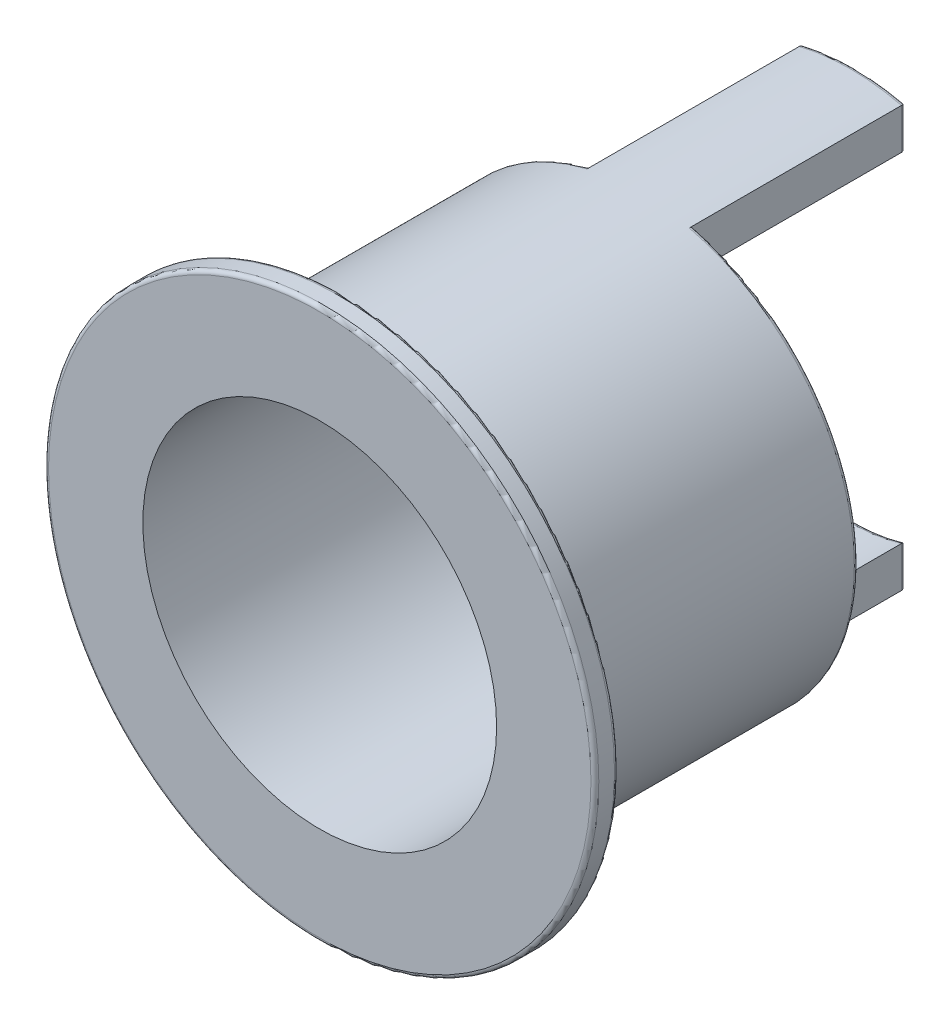
ISO-10303-21;
HEADER;
FILE_DESCRIPTION(('STEP AP214'),'2;1');
FILE_NAME('part.step','',(''),(''),'','','');
FILE_SCHEMA(('AUTOMOTIVE_DESIGN { 1 0 10303 214 1 1 1 1 }'));
ENDSEC;
DATA;
#1=APPLICATION_CONTEXT('core data for automotive mechanical design processes');
#2=APPLICATION_PROTOCOL_DEFINITION('international standard','automotive_design',2000,#1);
#3=PRODUCT_CONTEXT('',#1,'mechanical');
#4=PRODUCT('Part','Part','',(#3));
#5=PRODUCT_RELATED_PRODUCT_CATEGORY('part','',(#4));
#6=PRODUCT_DEFINITION_FORMATION('','',#4);
#7=PRODUCT_DEFINITION_CONTEXT('part definition',#1,'design');
#8=PRODUCT_DEFINITION('design','',#6,#7);
#9=PRODUCT_DEFINITION_SHAPE('','',#8);
#10=(LENGTH_UNIT() NAMED_UNIT(*) SI_UNIT(.MILLI.,.METRE.));
#11=(NAMED_UNIT(*) PLANE_ANGLE_UNIT() SI_UNIT($,.RADIAN.));
#12=(NAMED_UNIT(*) SI_UNIT($,.STERADIAN.) SOLID_ANGLE_UNIT());
#13=UNCERTAINTY_MEASURE_WITH_UNIT(LENGTH_MEASURE(1.E-05),#10,'distance_accuracy_value','');
#14=(GEOMETRIC_REPRESENTATION_CONTEXT(3) GLOBAL_UNCERTAINTY_ASSIGNED_CONTEXT((#13)) GLOBAL_UNIT_ASSIGNED_CONTEXT((#10,
#11,#12)) REPRESENTATION_CONTEXT('',''));
#15=CARTESIAN_POINT('',(0.,0.,0.));
#16=DIRECTION('',(0.,0.,1.));
#17=DIRECTION('',(1.,0.,0.));
#18=AXIS2_PLACEMENT_3D('',#15,#16,#17);
#19=CARTESIAN_POINT('',(0.,0.,0.3));
#20=DIRECTION('',(0.,0.,-1.));
#21=DIRECTION('',(-1.,0.,0.));
#22=AXIS2_PLACEMENT_3D('',#19,#20,#21);
#23=CYLINDRICAL_SURFACE('',#22,2.25);
#24=CARTESIAN_POINT('',(0.,0.,0.3));
#25=DIRECTION('',(0.,0.,1.));
#26=DIRECTION('',(1.,0.,0.));
#27=AXIS2_PLACEMENT_3D('',#24,#25,#26);
#28=CIRCLE('',#27,2.25);
#29=CARTESIAN_POINT('',(2.25,0.,0.3));
#30=VERTEX_POINT('',#29);
#31=EDGE_CURVE('E190',#30,#30,#28,.T.);
#32=ORIENTED_EDGE('',*,*,#31,.T.);
#33=EDGE_LOOP('',(#32));
#34=FACE_BOUND('',#33,.T.);
#35=DIRECTION('',(0.,0.,-1.));
#36=VECTOR('',#35,1.);
#37=CARTESIAN_POINT('',(0.65,-2.1540659228538,-3.8));
#38=LINE('',#37,#36);
#39=CARTESIAN_POINT('',(0.65,-2.1540659228538,-3.8));
#40=VERTEX_POINT('',#39);
#41=CARTESIAN_POINT('',(0.65,-2.1540659228538,-6.45));
#42=VERTEX_POINT('',#41);
#43=EDGE_CURVE('E183',#40,#42,#38,.T.);
#44=ORIENTED_EDGE('',*,*,#43,.T.);
#45=CARTESIAN_POINT('',(0.,0.,-6.45));
#46=DIRECTION('',(0.,0.,1.));
#47=DIRECTION('',(1.,0.,0.));
#48=AXIS2_PLACEMENT_3D('',#45,#46,#47);
#49=CIRCLE('',#48,2.25);
#50=CARTESIAN_POINT('',(-0.65,-2.1540659228538,-6.45));
#51=VERTEX_POINT('',#50);
#52=EDGE_CURVE('E230',#42,#51,#49,.F.);
#53=ORIENTED_EDGE('',*,*,#52,.T.);
#54=DIRECTION('',(0.,0.,-1.));
#55=VECTOR('',#54,1.);
#56=CARTESIAN_POINT('',(-0.65,-2.1540659228538,-3.8));
#57=LINE('',#56,#55);
#58=CARTESIAN_POINT('',(-0.65,-2.1540659228538,-3.8));
#59=VERTEX_POINT('',#58);
#60=EDGE_CURVE('E151',#59,#51,#57,.T.);
#61=ORIENTED_EDGE('',*,*,#60,.F.);
#62=CARTESIAN_POINT('',(0.,0.,-3.8));
#63=DIRECTION('',(0.,0.,-1.));
#64=DIRECTION('',(-1.,0.,0.));
#65=AXIS2_PLACEMENT_3D('',#62,#63,#64);
#66=CIRCLE('',#65,2.25);
#67=CARTESIAN_POINT('',(-0.65,2.1540659228538,-3.8));
#68=VERTEX_POINT('',#67);
#69=EDGE_CURVE('E158',#68,#59,#66,.F.);
#70=ORIENTED_EDGE('',*,*,#69,.F.);
#71=DIRECTION('',(0.,0.,-1.));
#72=VECTOR('',#71,1.);
#73=CARTESIAN_POINT('',(-0.65,2.1540659228538,-3.8));
#74=LINE('',#73,#72);
#75=CARTESIAN_POINT('',(-0.65,2.1540659228538,-6.45));
#76=VERTEX_POINT('',#75);
#77=EDGE_CURVE('E143',#68,#76,#74,.T.);
#78=ORIENTED_EDGE('',*,*,#77,.T.);
#79=CARTESIAN_POINT('',(0.,0.,-6.45));
#80=DIRECTION('',(0.,0.,1.));
#81=DIRECTION('',(1.,0.,0.));
#82=AXIS2_PLACEMENT_3D('',#79,#80,#81);
#83=CIRCLE('',#82,2.25);
#84=CARTESIAN_POINT('',(0.65,2.1540659228538,-6.45));
#85=VERTEX_POINT('',#84);
#86=EDGE_CURVE('E228',#76,#85,#83,.F.);
#87=ORIENTED_EDGE('',*,*,#86,.T.);
#88=DIRECTION('',(0.,0.,-1.));
#89=VECTOR('',#88,1.);
#90=CARTESIAN_POINT('',(0.65,2.1540659228538,-3.8));
#91=LINE('',#90,#89);
#92=CARTESIAN_POINT('',(0.65,2.1540659228538,-3.8));
#93=VERTEX_POINT('',#92);
#94=EDGE_CURVE('E180',#93,#85,#91,.T.);
#95=ORIENTED_EDGE('',*,*,#94,.F.);
#96=CARTESIAN_POINT('',(0.,0.,-3.8));
#97=DIRECTION('',(0.,0.,-1.));
#98=DIRECTION('',(-1.,0.,0.));
#99=AXIS2_PLACEMENT_3D('',#96,#97,#98);
#100=CIRCLE('',#99,2.25);
#101=EDGE_CURVE('E173',#40,#93,#100,.F.);
#102=ORIENTED_EDGE('',*,*,#101,.F.);
#103=EDGE_LOOP('',(#44,#53,#61,#70,#78,#87,#95,#102));
#104=FACE_BOUND('',#103,.T.);
#105=ADVANCED_FACE('F35',(#34,#104),#23,.F.);
#106=CARTESIAN_POINT('',(0.,0.,-6.5));
#107=DIRECTION('',(0.,0.,1.));
#108=DIRECTION('',(1.,0.,0.));
#109=AXIS2_PLACEMENT_3D('',#106,#107,#108);
#110=CYLINDRICAL_SURFACE('',#109,2.75);
#111=CARTESIAN_POINT('',(0.,0.,0.));
#112=DIRECTION('',(0.,0.,1.));
#113=DIRECTION('',(1.,0.,0.));
#114=AXIS2_PLACEMENT_3D('',#111,#112,#113);
#115=CIRCLE('',#114,2.75);
#116=CARTESIAN_POINT('',(2.75,0.,0.));
#117=VERTEX_POINT('',#116);
#118=EDGE_CURVE('E179',#117,#117,#115,.T.);
#119=ORIENTED_EDGE('',*,*,#118,.F.);
#120=EDGE_LOOP('',(#119));
#121=FACE_BOUND('',#120,.T.);
#122=DIRECTION('',(0.,0.,-1.));
#123=VECTOR('',#122,1.);
#124=CARTESIAN_POINT('',(-0.65,-2.67207784317748,-3.8));
#125=LINE('',#124,#123);
#126=CARTESIAN_POINT('',(-0.65,-2.67207784317748,-3.75));
#127=VERTEX_POINT('',#126);
#128=CARTESIAN_POINT('',(-0.65,-2.67207784317748,-6.45));
#129=VERTEX_POINT('',#128);
#130=EDGE_CURVE('E65',#127,#129,#125,.T.);
#131=ORIENTED_EDGE('',*,*,#130,.T.);
#132=CARTESIAN_POINT('',(0.,0.,-6.45));
#133=DIRECTION('',(0.,0.,1.));
#134=DIRECTION('',(1.,0.,0.));
#135=AXIS2_PLACEMENT_3D('',#132,#133,#134);
#136=CIRCLE('',#135,2.75);
#137=CARTESIAN_POINT('',(0.65,-2.67207784317748,-6.45));
#138=VERTEX_POINT('',#137);
#139=EDGE_CURVE('E226',#129,#138,#136,.T.);
#140=ORIENTED_EDGE('',*,*,#139,.T.);
#141=DIRECTION('',(0.,0.,-1.));
#142=VECTOR('',#141,1.);
#143=CARTESIAN_POINT('',(0.65,-2.67207784317748,-3.8));
#144=LINE('',#143,#142);
#145=CARTESIAN_POINT('',(0.65,-2.67207784317748,-3.75));
#146=VERTEX_POINT('',#145);
#147=EDGE_CURVE('E185',#146,#138,#144,.T.);
#148=ORIENTED_EDGE('',*,*,#147,.F.);
#149=CARTESIAN_POINT('',(0.,0.,-3.75));
#150=DIRECTION('',(0.,0.,-1.));
#151=DIRECTION('',(-1.,0.,0.));
#152=AXIS2_PLACEMENT_3D('',#149,#150,#151);
#153=CIRCLE('',#152,2.75);
#154=CARTESIAN_POINT('',(0.65,2.67207784317748,-3.75));
#155=VERTEX_POINT('',#154);
#156=EDGE_CURVE('E219',#146,#155,#153,.F.);
#157=ORIENTED_EDGE('',*,*,#156,.T.);
#158=DIRECTION('',(0.,0.,-1.));
#159=VECTOR('',#158,1.);
#160=CARTESIAN_POINT('',(0.65,2.67207784317748,-3.8));
#161=LINE('',#160,#159);
#162=CARTESIAN_POINT('',(0.65,2.67207784317748,-6.45));
#163=VERTEX_POINT('',#162);
#164=EDGE_CURVE('E176',#155,#163,#161,.T.);
#165=ORIENTED_EDGE('',*,*,#164,.T.);
#166=CARTESIAN_POINT('',(0.,0.,-6.45));
#167=DIRECTION('',(0.,0.,1.));
#168=DIRECTION('',(1.,0.,0.));
#169=AXIS2_PLACEMENT_3D('',#166,#167,#168);
#170=CIRCLE('',#169,2.75);
#171=CARTESIAN_POINT('',(-0.65,2.67207784317748,-6.45));
#172=VERTEX_POINT('',#171);
#173=EDGE_CURVE('E224',#163,#172,#170,.T.);
#174=ORIENTED_EDGE('',*,*,#173,.T.);
#175=DIRECTION('',(0.,0.,-1.));
#176=VECTOR('',#175,1.);
#177=CARTESIAN_POINT('',(-0.65,2.67207784317748,-3.8));
#178=LINE('',#177,#176);
#179=CARTESIAN_POINT('',(-0.65,2.67207784317748,-3.75));
#180=VERTEX_POINT('',#179);
#181=EDGE_CURVE('E57',#180,#172,#178,.T.);
#182=ORIENTED_EDGE('',*,*,#181,.F.);
#183=CARTESIAN_POINT('',(0.,0.,-3.75));
#184=DIRECTION('',(0.,0.,-1.));
#185=DIRECTION('',(-1.,0.,0.));
#186=AXIS2_PLACEMENT_3D('',#183,#184,#185);
#187=CIRCLE('',#186,2.75);
#188=EDGE_CURVE('E222',#180,#127,#187,.F.);
#189=ORIENTED_EDGE('',*,*,#188,.T.);
#190=EDGE_LOOP('',(#131,#140,#148,#157,#165,#174,#182,#189));
#191=FACE_BOUND('',#190,.T.);
#192=ADVANCED_FACE('F312',(#121,#191),#110,.T.);
#193=CARTESIAN_POINT('',(0.,0.,-6.5));
#194=DIRECTION('',(0.,0.,1.));
#195=DIRECTION('',(1.,0.,0.));
#196=AXIS2_PLACEMENT_3D('',#193,#194,#195);
#197=PLANE('',#196);
#198=DIRECTION('',(0.,1.,0.));
#199=VECTOR('',#198,1.);
#200=CARTESIAN_POINT('',(0.6,0.,-6.5));
#201=LINE('',#200,#199);
#202=CARTESIAN_POINT('',(0.6,-2.22036033111745,-6.5));
#203=VERTEX_POINT('',#202);
#204=CARTESIAN_POINT('',(0.6,-2.63248931621764,-6.5));
#205=VERTEX_POINT('',#204);
#206=EDGE_CURVE('E200',#203,#205,#201,.F.);
#207=ORIENTED_EDGE('',*,*,#206,.T.);
#208=CARTESIAN_POINT('',(0.,0.,-6.5));
#209=DIRECTION('',(0.,0.,1.));
#210=DIRECTION('',(1.,0.,0.));
#211=AXIS2_PLACEMENT_3D('',#208,#209,#210);
#212=CIRCLE('',#211,2.7);
#213=CARTESIAN_POINT('',(-0.6,-2.63248931621764,-6.5));
#214=VERTEX_POINT('',#213);
#215=EDGE_CURVE('E203',#205,#214,#212,.F.);
#216=ORIENTED_EDGE('',*,*,#215,.T.);
#217=DIRECTION('',(0.,1.,0.));
#218=VECTOR('',#217,1.);
#219=CARTESIAN_POINT('',(-0.6,-2.1540659228538,-6.5));
#220=LINE('',#219,#218);
#221=CARTESIAN_POINT('',(-0.6,-2.22036033111745,-6.5));
#222=VERTEX_POINT('',#221);
#223=EDGE_CURVE('E198',#214,#222,#220,.T.);
#224=ORIENTED_EDGE('',*,*,#223,.T.);
#225=CARTESIAN_POINT('',(0.,0.,-6.5));
#226=DIRECTION('',(0.,0.,1.));
#227=DIRECTION('',(1.,0.,0.));
#228=AXIS2_PLACEMENT_3D('',#225,#226,#227);
#229=CIRCLE('',#228,2.3);
#230=EDGE_CURVE('E196',#222,#203,#229,.T.);
#231=ORIENTED_EDGE('',*,*,#230,.T.);
#232=EDGE_LOOP('',(#207,#216,#224,#231));
#233=FACE_BOUND('',#232,.T.);
#234=ADVANCED_FACE('F280',(#233),#197,.F.);
#235=DIRECTION('',(0.,1.,0.));
#236=VECTOR('',#235,1.);
#237=CARTESIAN_POINT('',(0.6,0.,-6.5));
#238=LINE('',#237,#236);
#239=CARTESIAN_POINT('',(0.6,2.63248931621764,-6.5));
#240=VERTEX_POINT('',#239);
#241=CARTESIAN_POINT('',(0.6,2.22036033111745,-6.5));
#242=VERTEX_POINT('',#241);
#243=EDGE_CURVE('E209',#240,#242,#238,.F.);
#244=ORIENTED_EDGE('',*,*,#243,.T.);
#245=CARTESIAN_POINT('',(0.,0.,-6.5));
#246=DIRECTION('',(0.,0.,1.));
#247=DIRECTION('',(1.,0.,0.));
#248=AXIS2_PLACEMENT_3D('',#245,#246,#247);
#249=CIRCLE('',#248,2.3);
#250=CARTESIAN_POINT('',(-0.6,2.22036033111745,-6.5));
#251=VERTEX_POINT('',#250);
#252=EDGE_CURVE('E214',#242,#251,#249,.T.);
#253=ORIENTED_EDGE('',*,*,#252,.T.);
#254=DIRECTION('',(0.,1.,0.));
#255=VECTOR('',#254,1.);
#256=CARTESIAN_POINT('',(-0.6,2.67207784317748,-6.5));
#257=LINE('',#256,#255);
#258=CARTESIAN_POINT('',(-0.6,2.63248931621764,-6.5));
#259=VERTEX_POINT('',#258);
#260=EDGE_CURVE('E211',#251,#259,#257,.T.);
#261=ORIENTED_EDGE('',*,*,#260,.T.);
#262=CARTESIAN_POINT('',(0.,0.,-6.5));
#263=DIRECTION('',(0.,0.,1.));
#264=DIRECTION('',(1.,0.,0.));
#265=AXIS2_PLACEMENT_3D('',#262,#263,#264);
#266=CIRCLE('',#265,2.7);
#267=EDGE_CURVE('E207',#259,#240,#266,.F.);
#268=ORIENTED_EDGE('',*,*,#267,.T.);
#269=EDGE_LOOP('',(#244,#253,#261,#268));
#270=FACE_BOUND('',#269,.T.);
#271=ADVANCED_FACE('F325',(#270),#197,.F.);
#272=CARTESIAN_POINT('',(0.,0.,0.3));
#273=DIRECTION('',(0.,0.,-1.));
#274=DIRECTION('',(-1.,0.,0.));
#275=AXIS2_PLACEMENT_3D('',#272,#273,#274);
#276=CYLINDRICAL_SURFACE('',#275,3.5);
#277=CARTESIAN_POINT('',(0.,0.,0.05));
#278=DIRECTION('',(0.,0.,1.));
#279=DIRECTION('',(1.,0.,0.));
#280=AXIS2_PLACEMENT_3D('',#277,#278,#279);
#281=CIRCLE('',#280,3.5);
#282=CARTESIAN_POINT('',(3.5,0.,0.05));
#283=VERTEX_POINT('',#282);
#284=EDGE_CURVE('E239',#283,#283,#281,.T.);
#285=ORIENTED_EDGE('',*,*,#284,.T.);
#286=EDGE_LOOP('',(#285));
#287=FACE_BOUND('',#286,.T.);
#288=CARTESIAN_POINT('',(0.,0.,0.25));
#289=DIRECTION('',(0.,0.,1.));
#290=DIRECTION('',(1.,0.,0.));
#291=AXIS2_PLACEMENT_3D('',#288,#289,#290);
#292=CIRCLE('',#291,3.5);
#293=CARTESIAN_POINT('',(3.5,0.,0.25));
#294=VERTEX_POINT('',#293);
#295=EDGE_CURVE('E236',#294,#294,#292,.F.);
#296=ORIENTED_EDGE('',*,*,#295,.T.);
#297=EDGE_LOOP('',(#296));
#298=FACE_BOUND('',#297,.T.);
#299=ADVANCED_FACE('F322',(#287,#298),#276,.T.);
#300=CARTESIAN_POINT('',(0.,0.,0.3));
#301=DIRECTION('',(0.,0.,1.));
#302=DIRECTION('',(1.,0.,0.));
#303=AXIS2_PLACEMENT_3D('',#300,#301,#302);
#304=PLANE('',#303);
#305=CARTESIAN_POINT('',(0.,0.,0.3));
#306=DIRECTION('',(0.,0.,1.));
#307=DIRECTION('',(1.,0.,0.));
#308=AXIS2_PLACEMENT_3D('',#305,#306,#307);
#309=CIRCLE('',#308,3.45);
#310=CARTESIAN_POINT('',(3.45,0.,0.3));
#311=VERTEX_POINT('',#310);
#312=EDGE_CURVE('E245',#311,#311,#309,.T.);
#313=ORIENTED_EDGE('',*,*,#312,.T.);
#314=EDGE_LOOP('',(#313));
#315=FACE_BOUND('',#314,.T.);
#316=ORIENTED_EDGE('',*,*,#31,.F.);
#317=EDGE_LOOP('',(#316));
#318=FACE_BOUND('',#317,.T.);
#319=ADVANCED_FACE('F324',(#315,#318),#304,.T.);
#320=CARTESIAN_POINT('',(0.,0.,0.));
#321=DIRECTION('',(0.,0.,1.));
#322=DIRECTION('',(1.,0.,0.));
#323=AXIS2_PLACEMENT_3D('',#320,#321,#322);
#324=PLANE('',#323);
#325=CARTESIAN_POINT('',(0.,0.,0.));
#326=DIRECTION('',(0.,0.,1.));
#327=DIRECTION('',(1.,0.,0.));
#328=AXIS2_PLACEMENT_3D('',#325,#326,#327);
#329=CIRCLE('',#328,3.45);
#330=CARTESIAN_POINT('',(3.45,0.,0.));
#331=VERTEX_POINT('',#330);
#332=EDGE_CURVE('E242',#331,#331,#329,.F.);
#333=ORIENTED_EDGE('',*,*,#332,.T.);
#334=EDGE_LOOP('',(#333));
#335=FACE_BOUND('',#334,.T.);
#336=ORIENTED_EDGE('',*,*,#118,.T.);
#337=EDGE_LOOP('',(#336));
#338=FACE_BOUND('',#337,.T.);
#339=ADVANCED_FACE('F278',(#335,#338),#324,.F.);
#340=CARTESIAN_POINT('',(0.65,0.,-3.8));
#341=DIRECTION('',(-1.,0.,0.));
#342=DIRECTION('',(0.,0.,1.));
#343=AXIS2_PLACEMENT_3D('',#340,#341,#342);
#344=PLANE('',#343);
#345=ORIENTED_EDGE('',*,*,#94,.T.);
#346=DIRECTION('',(0.,1.,0.));
#347=VECTOR('',#346,1.);
#348=CARTESIAN_POINT('',(0.65,0.,-6.45));
#349=LINE('',#348,#347);
#350=EDGE_CURVE('E217',#85,#163,#349,.T.);
#351=ORIENTED_EDGE('',*,*,#350,.T.);
#352=ORIENTED_EDGE('',*,*,#164,.F.);
#353=CARTESIAN_POINT('',(0.65,2.67207784317748,-3.75));
#354=CARTESIAN_POINT('',(0.65,2.67208055437262,-3.75275502605494));
#355=CARTESIAN_POINT('',(0.65,2.67184367337058,-3.75550887652452));
#356=CARTESIAN_POINT('',(0.65,2.67091128787452,-3.76093353461634));
#357=CARTESIAN_POINT('',(0.65,2.67021650507589,-3.76360446600158));
#358=CARTESIAN_POINT('',(0.65,2.66838857025386,-3.76879227552283));
#359=CARTESIAN_POINT('',(0.65,2.66725532737399,-3.77130912160443));
#360=CARTESIAN_POINT('',(0.65,2.66458751791474,-3.77611996754771));
#361=CARTESIAN_POINT('',(0.65,2.66305293313147,-3.77841395729469));
#362=CARTESIAN_POINT('',(0.65,2.65960838468513,-3.78274563383212));
#363=CARTESIAN_POINT('',(0.65,2.65769411071335,-3.78477989003485));
#364=CARTESIAN_POINT('',(0.65,2.65355893043453,-3.78850866687454));
#365=CARTESIAN_POINT('',(0.65,2.65133795308354,-3.79020310857411));
#366=CARTESIAN_POINT('',(0.65,2.64658899650202,-3.79325265552838));
#367=CARTESIAN_POINT('',(0.65,2.64405434728814,-3.79459736339326));
#368=CARTESIAN_POINT('',(0.65,2.63879955290801,-3.79685443926644));
#369=CARTESIAN_POINT('',(0.65,2.63607943993308,-3.79776688208643));
#370=CARTESIAN_POINT('',(0.65,2.63122565780154,-3.79896721295384));
#371=CARTESIAN_POINT('',(0.65,2.62911590710765,-3.79935432499709));
#372=CARTESIAN_POINT('',(0.65,2.62486815133671,-3.79987072191155));
#373=CARTESIAN_POINT('',(0.65,2.62273019110359,-3.80000037562665));
#374=CARTESIAN_POINT('',(0.65,2.62059153627595,-3.80000000000087));
#375=B_SPLINE_CURVE_WITH_KNOTS('',3,(#353,#354,#355,#356,#357,#358,#359,#360,#361,#362,#363,
#364,#365,#366,#367,#368,#369,#370,#371,#372,#373,#374),.UNSPECIFIED.,.F.,.F.,(4,2,2,2,2,2,2,2,
2,2,4),(0.,0.00825314095865636,0.0164933052149075,0.0247351778900676,0.0329774244613234,
0.0413192292891345,0.0496629696418601,0.0582319921036389,0.0667995309908979,0.0732194138784345,
0.0796300927601993),.UNSPECIFIED.);
#376=CARTESIAN_POINT('',(0.65,2.62059153627573,-3.8));
#377=VERTEX_POINT('',#376);
#378=EDGE_CURVE('E11',#155,#377,#375,.T.);
#379=ORIENTED_EDGE('',*,*,#378,.T.);
#380=DIRECTION('',(0.,1.,0.));
#381=VECTOR('',#380,1.);
#382=CARTESIAN_POINT('',(0.65,0.,-3.8));
#383=LINE('',#382,#381);
#384=EDGE_CURVE('E174',#93,#377,#383,.T.);
#385=ORIENTED_EDGE('',*,*,#384,.F.);
#386=EDGE_LOOP('',(#345,#351,#352,#379,#385));
#387=FACE_BOUND('',#386,.T.);
#388=ADVANCED_FACE('F274',(#387),#344,.F.);
#389=ORIENTED_EDGE('',*,*,#147,.T.);
#390=DIRECTION('',(0.,1.,0.));
#391=VECTOR('',#390,1.);
#392=CARTESIAN_POINT('',(0.65,0.,-6.45));
#393=LINE('',#392,#391);
#394=EDGE_CURVE('E193',#138,#42,#393,.T.);
#395=ORIENTED_EDGE('',*,*,#394,.T.);
#396=ORIENTED_EDGE('',*,*,#43,.F.);
#397=CARTESIAN_POINT('',(0.65,-2.62059153627573,-3.8));
#398=VERTEX_POINT('',#397);
#399=EDGE_CURVE('E169',#398,#40,#383,.T.);
#400=ORIENTED_EDGE('',*,*,#399,.F.);
#401=CARTESIAN_POINT('',(0.65,-2.62059153627573,-3.8));
#402=CARTESIAN_POINT('',(0.65,-2.62355267198316,-3.80000209995817));
#403=CARTESIAN_POINT('',(0.65,-2.62651364735228,-3.79975230359996));
#404=CARTESIAN_POINT('',(0.65,-2.63235314917123,-3.79876344213293));
#405=CARTESIAN_POINT('',(0.65,-2.63523166498479,-3.79802431420018));
#406=CARTESIAN_POINT('',(0.65,-2.64082555775887,-3.79607053763508));
#407=CARTESIAN_POINT('',(0.65,-2.64354080209469,-3.79485550829186));
#408=CARTESIAN_POINT('',(0.65,-2.64872362291465,-3.79198080072044));
#409=CARTESIAN_POINT('',(0.65,-2.651191307168,-3.79032131713918));
#410=CARTESIAN_POINT('',(0.65,-2.65576903966943,-3.7866278688989));
#411=CARTESIAN_POINT('',(0.65,-2.6578837997947,-3.78459974970935));
#412=CARTESIAN_POINT('',(0.65,-2.66173131233205,-3.78020750214472));
#413=CARTESIAN_POINT('',(0.65,-2.66346401655997,-3.77784333144925));
#414=CARTESIAN_POINT('',(0.65,-2.66644564939252,-3.77291775897531));
#415=CARTESIAN_POINT('',(0.65,-2.66770672764979,-3.77036370114554));
#416=CARTESIAN_POINT('',(0.65,-2.66976846225902,-3.76507726893598));
#417=CARTESIAN_POINT('',(0.65,-2.67056958328225,-3.76234507763462));
#418=CARTESIAN_POINT('',(0.65,-2.67144328194352,-3.75799136261363));
#419=CARTESIAN_POINT('',(0.65,-2.6716811200622,-3.75640126876431));
#420=CARTESIAN_POINT('',(0.65,-2.67199833789838,-3.75320771209655));
#421=CARTESIAN_POINT('',(0.65,-2.67207794933292,-3.75160427228618));
#422=CARTESIAN_POINT('',(0.65,-2.67207784317753,-3.75000000000001));
#423=B_SPLINE_CURVE_WITH_KNOTS('',3,(#401,#402,#403,#404,#405,#406,#407,#408,#409,#410,#411,
#412,#413,#414,#415,#416,#417,#418,#419,#420,#421,#422),.UNSPECIFIED.,.F.,.F.,(4,2,2,2,2,2,2,2,
2,2,4),(0.,0.00887276248436542,0.0177466643390615,0.0266276796707577,0.0355048119392705,
0.0442518279394468,0.0529999464658185,0.0615039683699978,0.0699993839100581,0.0748156544873766,
0.0796248666045519),.UNSPECIFIED.);
#424=EDGE_CURVE('E49',#398,#146,#423,.T.);
#425=ORIENTED_EDGE('',*,*,#424,.T.);
#426=EDGE_LOOP('',(#389,#395,#396,#400,#425));
#427=FACE_BOUND('',#426,.T.);
#428=ADVANCED_FACE('F272',(#427),#344,.F.);
#429=CARTESIAN_POINT('',(0.,0.,-3.8));
#430=DIRECTION('',(0.,0.,-1.));
#431=DIRECTION('',(-1.,0.,0.));
#432=AXIS2_PLACEMENT_3D('',#429,#430,#431);
#433=PLANE('',#432);
#434=ORIENTED_EDGE('',*,*,#384,.T.);
#435=CARTESIAN_POINT('',(0.,0.,-3.8));
#436=DIRECTION('',(0.,0.,-1.));
#437=DIRECTION('',(-1.,0.,0.));
#438=AXIS2_PLACEMENT_3D('',#435,#436,#437);
#439=CIRCLE('',#438,2.7);
#440=EDGE_CURVE('E233',#377,#398,#439,.T.);
#441=ORIENTED_EDGE('',*,*,#440,.T.);
#442=ORIENTED_EDGE('',*,*,#399,.T.);
#443=ORIENTED_EDGE('',*,*,#101,.T.);
#444=EDGE_LOOP('',(#434,#441,#442,#443));
#445=FACE_BOUND('',#444,.T.);
#446=ADVANCED_FACE('F268',(#445),#433,.T.);
#447=CARTESIAN_POINT('',(-0.65,0.,-3.8));
#448=DIRECTION('',(-1.,0.,0.));
#449=DIRECTION('',(0.,0.,1.));
#450=AXIS2_PLACEMENT_3D('',#447,#448,#449);
#451=PLANE('',#450);
#452=ORIENTED_EDGE('',*,*,#60,.T.);
#453=DIRECTION('',(0.,1.,0.));
#454=VECTOR('',#453,1.);
#455=CARTESIAN_POINT('',(-0.65,-2.67207784317748,-6.45));
#456=LINE('',#455,#454);
#457=EDGE_CURVE('E205',#51,#129,#456,.F.);
#458=ORIENTED_EDGE('',*,*,#457,.T.);
#459=ORIENTED_EDGE('',*,*,#130,.F.);
#460=CARTESIAN_POINT('',(-0.65,-2.67207784317748,-3.75));
#461=CARTESIAN_POINT('',(-0.65,-2.67208055437262,-3.75275502605494));
#462=CARTESIAN_POINT('',(-0.65,-2.67184367337058,-3.75550887652452));
#463=CARTESIAN_POINT('',(-0.65,-2.67091128787452,-3.76093353461634));
#464=CARTESIAN_POINT('',(-0.65,-2.67021650507589,-3.76360446600158));
#465=CARTESIAN_POINT('',(-0.65,-2.66838857025386,-3.76879227552283));
#466=CARTESIAN_POINT('',(-0.65,-2.66725532737399,-3.77130912160443));
#467=CARTESIAN_POINT('',(-0.65,-2.66458751791474,-3.77611996754771));
#468=CARTESIAN_POINT('',(-0.65,-2.66305293313147,-3.77841395729469));
#469=CARTESIAN_POINT('',(-0.65,-2.65960838468513,-3.78274563383212));
#470=CARTESIAN_POINT('',(-0.65,-2.65769411071335,-3.78477989003485));
#471=CARTESIAN_POINT('',(-0.65,-2.65355893043453,-3.78850866687454));
#472=CARTESIAN_POINT('',(-0.65,-2.65133795308354,-3.79020310857411));
#473=CARTESIAN_POINT('',(-0.65,-2.64658899650202,-3.79325265552838));
#474=CARTESIAN_POINT('',(-0.65,-2.64405434728814,-3.79459736339326));
#475=CARTESIAN_POINT('',(-0.65,-2.63879955290801,-3.79685443926644));
#476=CARTESIAN_POINT('',(-0.65,-2.63607943993308,-3.79776688208643));
#477=CARTESIAN_POINT('',(-0.65,-2.63122565780154,-3.79896721295384));
#478=CARTESIAN_POINT('',(-0.65,-2.62911590710765,-3.79935432499709));
#479=CARTESIAN_POINT('',(-0.65,-2.62486815133671,-3.79987072191155));
#480=CARTESIAN_POINT('',(-0.65,-2.62273019110359,-3.80000037562665));
#481=CARTESIAN_POINT('',(-0.65,-2.62059153627595,-3.80000000000087));
#482=B_SPLINE_CURVE_WITH_KNOTS('',3,(#460,#461,#462,#463,#464,#465,#466,#467,#468,#469,#470,
#471,#472,#473,#474,#475,#476,#477,#478,#479,#480,#481),.UNSPECIFIED.,.F.,.F.,(4,2,2,2,2,2,2,2,
2,2,4),(0.,0.00825314095865636,0.0164933052149075,0.0247351778900676,0.0329774244613234,
0.0413192292891345,0.0496629696418601,0.0582319921036389,0.0667995309908979,0.0732194138784345,
0.0796300927601993),.UNSPECIFIED.);
#483=CARTESIAN_POINT('',(-0.65,-2.62059153627573,-3.8));
#484=VERTEX_POINT('',#483);
#485=EDGE_CURVE('E255',#127,#484,#482,.T.);
#486=ORIENTED_EDGE('',*,*,#485,.T.);
#487=DIRECTION('',(0.,1.,0.));
#488=VECTOR('',#487,1.);
#489=CARTESIAN_POINT('',(-0.65,0.,-3.8));
#490=LINE('',#489,#488);
#491=EDGE_CURVE('E162',#484,#59,#490,.T.);
#492=ORIENTED_EDGE('',*,*,#491,.T.);
#493=EDGE_LOOP('',(#452,#458,#459,#486,#492));
#494=FACE_BOUND('',#493,.T.);
#495=ADVANCED_FACE('F267',(#494),#451,.T.);
#496=ORIENTED_EDGE('',*,*,#181,.T.);
#497=DIRECTION('',(0.,1.,0.));
#498=VECTOR('',#497,1.);
#499=CARTESIAN_POINT('',(-0.65,2.1540659228538,-6.45));
#500=LINE('',#499,#498);
#501=EDGE_CURVE('E148',#172,#76,#500,.F.);
#502=ORIENTED_EDGE('',*,*,#501,.T.);
#503=ORIENTED_EDGE('',*,*,#77,.F.);
#504=CARTESIAN_POINT('',(-0.65,2.62059153627573,-3.8));
#505=VERTEX_POINT('',#504);
#506=EDGE_CURVE('E146',#68,#505,#490,.T.);
#507=ORIENTED_EDGE('',*,*,#506,.T.);
#508=CARTESIAN_POINT('',(-0.65,2.62059153627573,-3.8));
#509=CARTESIAN_POINT('',(-0.65,2.62355267198316,-3.80000209995817));
#510=CARTESIAN_POINT('',(-0.65,2.62651364735228,-3.79975230359996));
#511=CARTESIAN_POINT('',(-0.65,2.63235314917123,-3.79876344213293));
#512=CARTESIAN_POINT('',(-0.65,2.63523166498479,-3.79802431420018));
#513=CARTESIAN_POINT('',(-0.65,2.64082555775887,-3.79607053763508));
#514=CARTESIAN_POINT('',(-0.65,2.64354080209469,-3.79485550829186));
#515=CARTESIAN_POINT('',(-0.65,2.64872362291465,-3.79198080072044));
#516=CARTESIAN_POINT('',(-0.65,2.651191307168,-3.79032131713918));
#517=CARTESIAN_POINT('',(-0.65,2.65576903966943,-3.7866278688989));
#518=CARTESIAN_POINT('',(-0.65,2.6578837997947,-3.78459974970935));
#519=CARTESIAN_POINT('',(-0.65,2.66173131233205,-3.78020750214472));
#520=CARTESIAN_POINT('',(-0.65,2.66346401655997,-3.77784333144925));
#521=CARTESIAN_POINT('',(-0.65,2.66644564939252,-3.77291775897531));
#522=CARTESIAN_POINT('',(-0.65,2.66770672764979,-3.77036370114554));
#523=CARTESIAN_POINT('',(-0.65,2.66976846225902,-3.76507726893598));
#524=CARTESIAN_POINT('',(-0.65,2.67056958328225,-3.76234507763462));
#525=CARTESIAN_POINT('',(-0.65,2.67144328194352,-3.75799136261363));
#526=CARTESIAN_POINT('',(-0.65,2.6716811200622,-3.75640126876431));
#527=CARTESIAN_POINT('',(-0.65,2.67199833789838,-3.75320771209655));
#528=CARTESIAN_POINT('',(-0.65,2.67207794933292,-3.75160427228618));
#529=CARTESIAN_POINT('',(-0.65,2.67207784317753,-3.75000000000001));
#530=B_SPLINE_CURVE_WITH_KNOTS('',3,(#508,#509,#510,#511,#512,#513,#514,#515,#516,#517,#518,
#519,#520,#521,#522,#523,#524,#525,#526,#527,#528,#529),.UNSPECIFIED.,.F.,.F.,(4,2,2,2,2,2,2,2,
2,2,4),(0.,0.00887276248436542,0.0177466643390615,0.0266276796707577,0.0355048119392705,
0.0442518279394468,0.0529999464658185,0.0615039683699978,0.0699993839100581,0.0748156544873766,
0.0796248666045519),.UNSPECIFIED.);
#531=EDGE_CURVE('E248',#505,#180,#530,.T.);
#532=ORIENTED_EDGE('',*,*,#531,.T.);
#533=EDGE_LOOP('',(#496,#502,#503,#507,#532));
#534=FACE_BOUND('',#533,.T.);
#535=ADVANCED_FACE('F145',(#534),#451,.T.);
#536=CARTESIAN_POINT('',(0.,0.,-3.8));
#537=DIRECTION('',(0.,0.,-1.));
#538=DIRECTION('',(-1.,0.,0.));
#539=AXIS2_PLACEMENT_3D('',#536,#537,#538);
#540=PLANE('',#539);
#541=ORIENTED_EDGE('',*,*,#491,.F.);
#542=CARTESIAN_POINT('',(0.,0.,-3.8));
#543=DIRECTION('',(0.,0.,-1.));
#544=DIRECTION('',(-1.,0.,0.));
#545=AXIS2_PLACEMENT_3D('',#542,#543,#544);
#546=CIRCLE('',#545,2.7);
#547=EDGE_CURVE('E161',#484,#505,#546,.T.);
#548=ORIENTED_EDGE('',*,*,#547,.T.);
#549=ORIENTED_EDGE('',*,*,#506,.F.);
#550=ORIENTED_EDGE('',*,*,#69,.T.);
#551=EDGE_LOOP('',(#541,#548,#549,#550));
#552=FACE_BOUND('',#551,.T.);
#553=ADVANCED_FACE('F157',(#552),#540,.T.);
#554=CARTESIAN_POINT('',(-0.6,0.,-6.45));
#555=DIRECTION('',(0.,-1.,0.));
#556=DIRECTION('',(0.,0.,-1.));
#557=AXIS2_PLACEMENT_3D('',#554,#555,#556);
#558=CYLINDRICAL_SURFACE('',#557,0.05);
#559=CARTESIAN_POINT('',(-0.65,-2.1540659228538,-6.45));
#560=CARTESIAN_POINT('',(-0.650003931189581,-2.15406056812313,-6.45205672576726));
#561=CARTESIAN_POINT('',(-0.649873368331366,-2.15423640983399,-6.45410484315972));
#562=CARTESIAN_POINT('',(-0.649379614424196,-2.15490102113498,-6.45809551680692));
#563=CARTESIAN_POINT('',(-0.649019332543681,-2.15538587732382,-6.4600390681462));
#564=CARTESIAN_POINT('',(-0.648103112317912,-2.15661825531507,-6.46377753051844));
#565=CARTESIAN_POINT('',(-0.647548114482591,-2.15736451447134,-6.46557310571107));
#566=CARTESIAN_POINT('',(-0.646282206612608,-2.15906552382515,-6.46900826028287));
#567=CARTESIAN_POINT('',(-0.645570778904845,-2.1600209662263,-6.47064729516325));
#568=CARTESIAN_POINT('',(-0.643596891146696,-2.16266978595329,-6.47463053776732));
#569=CARTESIAN_POINT('',(-0.642248831802075,-2.16447694892296,-6.47685621597091));
#570=CARTESIAN_POINT('',(-0.639362285450766,-2.16834096096709,-6.48093327823637));
#571=CARTESIAN_POINT('',(-0.637823369579569,-2.17039837215517,-6.48278379379655));
#572=CARTESIAN_POINT('',(-0.63364701284329,-2.17597312257072,-6.48717330010931));
#573=CARTESIAN_POINT('',(-0.63090869006996,-2.17962005563459,-6.48945058208406));
#574=CARTESIAN_POINT('',(-0.625250002998866,-2.18713608159962,-6.49329119250977));
#575=CARTESIAN_POINT('',(-0.622329316116103,-2.19100556716412,-6.49485321259556));
#576=CARTESIAN_POINT('',(-0.616346732914417,-2.19890990281836,-6.49736481436702));
#577=CARTESIAN_POINT('',(-0.613283537801554,-2.20294620530764,-6.49830659110421));
#578=CARTESIAN_POINT('',(-0.607106728148967,-2.21106250731307,-6.49959252597586));
#579=CARTESIAN_POINT('',(-0.603993226841235,-2.21514240315594,-6.49993787691024));
#580=CARTESIAN_POINT('',(-0.600583281071663,-2.21959841349018,-6.49999743864055));
#581=CARTESIAN_POINT('',(-0.600291652235803,-2.21997940638207,-6.49999998848632));
#582=CARTESIAN_POINT('',(-0.6,-2.22036033111745,-6.5));
#583=B_SPLINE_CURVE_WITH_KNOTS('',3,(#559,#560,#561,#562,#563,#564,#565,#566,#567,#568,#569,
#570,#571,#572,#573,#574,#575,#576,#577,#578,#579,#580,#581,#582),.UNSPECIFIED.,.F.,.F.,(4,2,2,
2,2,2,2,2,2,2,2,4),(0.,0.00614491790225878,0.0122135214952283,0.0182532073813219,
0.0243131895415216,0.0337636771657915,0.0432357989450423,0.0584440562380893,0.0736800225965097,
0.0891042254787055,0.104497545415458,0.105936918344726),.UNSPECIFIED.);
#584=EDGE_CURVE('E337',#222,#51,#583,.F.);
#585=ORIENTED_EDGE('',*,*,#584,.F.);
#586=ORIENTED_EDGE('',*,*,#223,.F.);
#587=CARTESIAN_POINT('',(-0.65,-2.67207784317748,-6.45));
#588=CARTESIAN_POINT('',(-0.650003619733486,-2.67208065167523,-6.45238948493488));
#589=CARTESIAN_POINT('',(-0.649828972303469,-2.67194343219809,-6.45477480582925));
#590=CARTESIAN_POINT('',(-0.649153449293562,-2.67141247409812,-6.45945480037231));
#591=CARTESIAN_POINT('',(-0.648654612092555,-2.67102033828555,-6.4617499460235));
#592=CARTESIAN_POINT('',(-0.647361446265311,-2.67000342971419,-6.46619493615293));
#593=CARTESIAN_POINT('',(-0.646567620118007,-2.66937905254948,-6.46834502040954));
#594=CARTESIAN_POINT('',(-0.644726847760847,-2.66793052534607,-6.47246331386871));
#595=CARTESIAN_POINT('',(-0.643679570472827,-2.66710611400303,-6.4744312804879));
#596=CARTESIAN_POINT('',(-0.641291814612732,-2.6652254246842,-6.4782933823054));
#597=CARTESIAN_POINT('',(-0.639935447192331,-2.66415656120126,-6.48017146933226));
#598=CARTESIAN_POINT('',(-0.63703337931405,-2.66186804845533,-6.48367052120276));
#599=CARTESIAN_POINT('',(-0.635487579289663,-2.66064831989392,-6.48529134979431));
#600=CARTESIAN_POINT('',(-0.631481707747013,-2.65748503353759,-6.48897977530699));
#601=CARTESIAN_POINT('',(-0.628935450431983,-2.65547232611999,-6.49089522691084));
#602=CARTESIAN_POINT('',(-0.623633493786744,-2.65127612575662,-6.49417242965383));
#603=CARTESIAN_POINT('',(-0.620877405933418,-2.64909231576773,-6.49553312247835));
#604=CARTESIAN_POINT('',(-0.615311015281933,-2.64467597735718,-6.49768921219331));
#605=CARTESIAN_POINT('',(-0.612503694664516,-2.64244595301761,-6.4984976409529));
#606=CARTESIAN_POINT('',(-0.606837022940588,-2.63793869470926,-6.4996142171878));
#607=CARTESIAN_POINT('',(-0.603977798436961,-2.6356615741092,-6.49992345015817));
#608=CARTESIAN_POINT('',(-0.600746426155107,-2.633084708172,-6.4999958211206));
#609=CARTESIAN_POINT('',(-0.600373169928221,-2.63278700330943,-6.49999999835586));
#610=CARTESIAN_POINT('',(-0.6,-2.63248931621764,-6.5));
#611=B_SPLINE_CURVE_WITH_KNOTS('',3,(#587,#588,#589,#590,#591,#592,#593,#594,#595,#596,#597,
#598,#599,#600,#601,#602,#603,#604,#605,#606,#607,#608,#609,#610),.UNSPECIFIED.,.F.,.F.,(4,2,2,
2,2,2,2,2,2,2,2,4),(0.,0.00715157309637369,0.0142586093369294,0.0213535946599757,
0.0284578985265512,0.0360841752909579,0.0437144777877484,0.0549598082035327,0.0662264920971279,
0.0772171676635434,0.0881839117923096,0.0896161993381757),.UNSPECIFIED.);
#612=EDGE_CURVE('E344',#129,#214,#611,.T.);
#613=ORIENTED_EDGE('',*,*,#612,.F.);
#614=ORIENTED_EDGE('',*,*,#457,.F.);
#615=EDGE_LOOP('',(#585,#586,#613,#614));
#616=FACE_BOUND('',#615,.T.);
#617=ADVANCED_FACE('F353',(#616),#558,.T.);
#618=CARTESIAN_POINT('',(0.,0.,-6.45));
#619=DIRECTION('',(0.,0.,1.));
#620=DIRECTION('',(1.,0.,0.));
#621=AXIS2_PLACEMENT_3D('',#618,#619,#620);
#622=TOROIDAL_SURFACE('',#621,2.7,0.05);
#623=ORIENTED_EDGE('',*,*,#612,.T.);
#624=ORIENTED_EDGE('',*,*,#215,.F.);
#625=CARTESIAN_POINT('',(0.65,-2.67207784317748,-6.45));
#626=CARTESIAN_POINT('',(0.650003619733486,-2.67208065167523,-6.45238948493488));
#627=CARTESIAN_POINT('',(0.649828972303469,-2.67194343219809,-6.45477480582925));
#628=CARTESIAN_POINT('',(0.649153449293562,-2.67141247409812,-6.45945480037231));
#629=CARTESIAN_POINT('',(0.648654612092555,-2.67102033828555,-6.4617499460235));
#630=CARTESIAN_POINT('',(0.647361446265311,-2.67000342971419,-6.46619493615293));
#631=CARTESIAN_POINT('',(0.646567620118007,-2.66937905254948,-6.46834502040954));
#632=CARTESIAN_POINT('',(0.644726847760847,-2.66793052534607,-6.47246331386871));
#633=CARTESIAN_POINT('',(0.643679570472827,-2.66710611400303,-6.4744312804879));
#634=CARTESIAN_POINT('',(0.641291814612732,-2.6652254246842,-6.4782933823054));
#635=CARTESIAN_POINT('',(0.639935447192331,-2.66415656120126,-6.48017146933226));
#636=CARTESIAN_POINT('',(0.63703337931405,-2.66186804845533,-6.48367052120276));
#637=CARTESIAN_POINT('',(0.635487579289663,-2.66064831989392,-6.48529134979431));
#638=CARTESIAN_POINT('',(0.631481707747013,-2.65748503353759,-6.48897977530699));
#639=CARTESIAN_POINT('',(0.628935450431983,-2.65547232611999,-6.49089522691084));
#640=CARTESIAN_POINT('',(0.623633493786744,-2.65127612575662,-6.49417242965383));
#641=CARTESIAN_POINT('',(0.620877405933418,-2.64909231576773,-6.49553312247835));
#642=CARTESIAN_POINT('',(0.615311015281933,-2.64467597735718,-6.49768921219331));
#643=CARTESIAN_POINT('',(0.612503694664516,-2.64244595301761,-6.4984976409529));
#644=CARTESIAN_POINT('',(0.606837022940588,-2.63793869470926,-6.4996142171878));
#645=CARTESIAN_POINT('',(0.603977798436961,-2.6356615741092,-6.49992345015817));
#646=CARTESIAN_POINT('',(0.600746426155107,-2.633084708172,-6.4999958211206));
#647=CARTESIAN_POINT('',(0.600373169928221,-2.63278700330943,-6.49999999835586));
#648=CARTESIAN_POINT('',(0.6,-2.63248931621764,-6.5));
#649=B_SPLINE_CURVE_WITH_KNOTS('',3,(#625,#626,#627,#628,#629,#630,#631,#632,#633,#634,#635,
#636,#637,#638,#639,#640,#641,#642,#643,#644,#645,#646,#647,#648),.UNSPECIFIED.,.F.,.F.,(4,2,2,
2,2,2,2,2,2,2,2,4),(0.,0.00715157309637369,0.0142586093369294,0.0213535946599757,
0.0284578985265512,0.0360841752909579,0.0437144777877484,0.0549598082035327,0.0662264920971279,
0.0772171676635434,0.0881839117923096,0.0896161993381757),.UNSPECIFIED.);
#650=EDGE_CURVE('E345',#138,#205,#649,.T.);
#651=ORIENTED_EDGE('',*,*,#650,.F.);
#652=ORIENTED_EDGE('',*,*,#139,.F.);
#653=EDGE_LOOP('',(#623,#624,#651,#652));
#654=FACE_BOUND('',#653,.T.);
#655=ADVANCED_FACE('F331',(#654),#622,.T.);
#656=CARTESIAN_POINT('',(0.,0.,-6.45));
#657=DIRECTION('',(0.,0.,1.));
#658=DIRECTION('',(1.,0.,0.));
#659=AXIS2_PLACEMENT_3D('',#656,#657,#658);
#660=TOROIDAL_SURFACE('',#659,2.3,0.05);
#661=ORIENTED_EDGE('',*,*,#584,.T.);
#662=ORIENTED_EDGE('',*,*,#52,.F.);
#663=CARTESIAN_POINT('',(0.65,-2.1540659228538,-6.45));
#664=CARTESIAN_POINT('',(0.650003931189581,-2.15406056812313,-6.45205672576726));
#665=CARTESIAN_POINT('',(0.649873368331366,-2.15423640983399,-6.45410484315972));
#666=CARTESIAN_POINT('',(0.649379614424196,-2.15490102113498,-6.45809551680692));
#667=CARTESIAN_POINT('',(0.649019332543681,-2.15538587732382,-6.4600390681462));
#668=CARTESIAN_POINT('',(0.648103112317912,-2.15661825531507,-6.46377753051844));
#669=CARTESIAN_POINT('',(0.647548114482591,-2.15736451447134,-6.46557310571107));
#670=CARTESIAN_POINT('',(0.646282206612608,-2.15906552382515,-6.46900826028287));
#671=CARTESIAN_POINT('',(0.645570778904845,-2.1600209662263,-6.47064729516325));
#672=CARTESIAN_POINT('',(0.643596891146696,-2.16266978595329,-6.47463053776732));
#673=CARTESIAN_POINT('',(0.642248831802075,-2.16447694892296,-6.47685621597091));
#674=CARTESIAN_POINT('',(0.639362285450766,-2.16834096096709,-6.48093327823637));
#675=CARTESIAN_POINT('',(0.637823369579569,-2.17039837215517,-6.48278379379655));
#676=CARTESIAN_POINT('',(0.63364701284329,-2.17597312257072,-6.48717330010931));
#677=CARTESIAN_POINT('',(0.63090869006996,-2.17962005563459,-6.48945058208406));
#678=CARTESIAN_POINT('',(0.625250002998866,-2.18713608159962,-6.49329119250977));
#679=CARTESIAN_POINT('',(0.622329316116103,-2.19100556716412,-6.49485321259556));
#680=CARTESIAN_POINT('',(0.616346732914417,-2.19890990281836,-6.49736481436702));
#681=CARTESIAN_POINT('',(0.613283537801554,-2.20294620530764,-6.49830659110421));
#682=CARTESIAN_POINT('',(0.607106728148967,-2.21106250731307,-6.49959252597586));
#683=CARTESIAN_POINT('',(0.603993226841235,-2.21514240315594,-6.49993787691024));
#684=CARTESIAN_POINT('',(0.600583281071663,-2.21959841349018,-6.49999743864055));
#685=CARTESIAN_POINT('',(0.600291652235803,-2.21997940638207,-6.49999998848632));
#686=CARTESIAN_POINT('',(0.6,-2.22036033111745,-6.5));
#687=B_SPLINE_CURVE_WITH_KNOTS('',3,(#663,#664,#665,#666,#667,#668,#669,#670,#671,#672,#673,
#674,#675,#676,#677,#678,#679,#680,#681,#682,#683,#684,#685,#686),.UNSPECIFIED.,.F.,.F.,(4,2,2,
2,2,2,2,2,2,2,2,4),(0.,0.00614491790225878,0.0122135214952283,0.0182532073813219,
0.0243131895415216,0.0337636771657915,0.0432357989450423,0.0584440562380893,0.0736800225965097,
0.0891042254787055,0.104497545415458,0.105936918344726),.UNSPECIFIED.);
#688=EDGE_CURVE('E290',#203,#42,#687,.F.);
#689=ORIENTED_EDGE('',*,*,#688,.F.);
#690=ORIENTED_EDGE('',*,*,#230,.F.);
#691=EDGE_LOOP('',(#661,#662,#689,#690));
#692=FACE_BOUND('',#691,.T.);
#693=ADVANCED_FACE('F327',(#692),#660,.T.);
#694=CARTESIAN_POINT('',(0.6,0.,-6.45));
#695=DIRECTION('',(0.,1.,0.));
#696=DIRECTION('',(0.,0.,1.));
#697=AXIS2_PLACEMENT_3D('',#694,#695,#696);
#698=CYLINDRICAL_SURFACE('',#697,0.05);
#699=ORIENTED_EDGE('',*,*,#650,.T.);
#700=ORIENTED_EDGE('',*,*,#206,.F.);
#701=ORIENTED_EDGE('',*,*,#688,.T.);
#702=ORIENTED_EDGE('',*,*,#394,.F.);
#703=EDGE_LOOP('',(#699,#700,#701,#702));
#704=FACE_BOUND('',#703,.T.);
#705=ADVANCED_FACE('F330',(#704),#698,.T.);
#706=CARTESIAN_POINT('',(0.6,0.,-6.45));
#707=DIRECTION('',(0.,1.,0.));
#708=DIRECTION('',(0.,0.,1.));
#709=AXIS2_PLACEMENT_3D('',#706,#707,#708);
#710=CYLINDRICAL_SURFACE('',#709,0.05);
#711=CARTESIAN_POINT('',(0.65,2.67207784317748,-6.45));
#712=CARTESIAN_POINT('',(0.650003619733486,2.67208065167523,-6.45238948493488));
#713=CARTESIAN_POINT('',(0.649828972303469,2.67194343219809,-6.45477480582925));
#714=CARTESIAN_POINT('',(0.649153449293562,2.67141247409812,-6.45945480037231));
#715=CARTESIAN_POINT('',(0.648654612092555,2.67102033828555,-6.4617499460235));
#716=CARTESIAN_POINT('',(0.647361446265311,2.67000342971419,-6.46619493615293));
#717=CARTESIAN_POINT('',(0.646567620118007,2.66937905254948,-6.46834502040954));
#718=CARTESIAN_POINT('',(0.644726847760847,2.66793052534607,-6.47246331386871));
#719=CARTESIAN_POINT('',(0.643679570472827,2.66710611400303,-6.4744312804879));
#720=CARTESIAN_POINT('',(0.641291814612732,2.6652254246842,-6.4782933823054));
#721=CARTESIAN_POINT('',(0.639935447192331,2.66415656120126,-6.48017146933226));
#722=CARTESIAN_POINT('',(0.63703337931405,2.66186804845533,-6.48367052120276));
#723=CARTESIAN_POINT('',(0.635487579289663,2.66064831989392,-6.48529134979431));
#724=CARTESIAN_POINT('',(0.631481707747013,2.65748503353759,-6.48897977530699));
#725=CARTESIAN_POINT('',(0.628935450431983,2.65547232611999,-6.49089522691084));
#726=CARTESIAN_POINT('',(0.623633493786744,2.65127612575662,-6.49417242965383));
#727=CARTESIAN_POINT('',(0.620877405933418,2.64909231576773,-6.49553312247835));
#728=CARTESIAN_POINT('',(0.615311015281933,2.64467597735718,-6.49768921219331));
#729=CARTESIAN_POINT('',(0.612503694664516,2.64244595301761,-6.4984976409529));
#730=CARTESIAN_POINT('',(0.606837022940588,2.63793869470926,-6.4996142171878));
#731=CARTESIAN_POINT('',(0.603977798436961,2.6356615741092,-6.49992345015817));
#732=CARTESIAN_POINT('',(0.600746426155107,2.633084708172,-6.4999958211206));
#733=CARTESIAN_POINT('',(0.600373169928221,2.63278700330943,-6.49999999835586));
#734=CARTESIAN_POINT('',(0.6,2.63248931621764,-6.5));
#735=B_SPLINE_CURVE_WITH_KNOTS('',3,(#711,#712,#713,#714,#715,#716,#717,#718,#719,#720,#721,
#722,#723,#724,#725,#726,#727,#728,#729,#730,#731,#732,#733,#734),.UNSPECIFIED.,.F.,.F.,(4,2,2,
2,2,2,2,2,2,2,2,4),(0.,0.00715157309637369,0.0142586093369294,0.0213535946599757,
0.0284578985265512,0.0360841752909579,0.0437144777877484,0.0549598082035327,0.0662264920971279,
0.0772171676635434,0.0881839117923096,0.0896161993381757),.UNSPECIFIED.);
#736=EDGE_CURVE('E377',#163,#240,#735,.T.);
#737=ORIENTED_EDGE('',*,*,#736,.F.);
#738=ORIENTED_EDGE('',*,*,#350,.F.);
#739=CARTESIAN_POINT('',(0.65,2.1540659228538,-6.45));
#740=CARTESIAN_POINT('',(0.650003931189581,2.15406056812313,-6.45205672576726));
#741=CARTESIAN_POINT('',(0.649873368331366,2.15423640983399,-6.45410484315972));
#742=CARTESIAN_POINT('',(0.649379614424196,2.15490102113498,-6.45809551680692));
#743=CARTESIAN_POINT('',(0.649019332543681,2.15538587732382,-6.4600390681462));
#744=CARTESIAN_POINT('',(0.648103112317912,2.15661825531507,-6.46377753051844));
#745=CARTESIAN_POINT('',(0.647548114482591,2.15736451447134,-6.46557310571107));
#746=CARTESIAN_POINT('',(0.646282206612608,2.15906552382515,-6.46900826028287));
#747=CARTESIAN_POINT('',(0.645570778904845,2.1600209662263,-6.47064729516325));
#748=CARTESIAN_POINT('',(0.643596891146696,2.16266978595329,-6.47463053776732));
#749=CARTESIAN_POINT('',(0.642248831802075,2.16447694892296,-6.47685621597091));
#750=CARTESIAN_POINT('',(0.639362285450766,2.16834096096709,-6.48093327823637));
#751=CARTESIAN_POINT('',(0.637823369579569,2.17039837215517,-6.48278379379655));
#752=CARTESIAN_POINT('',(0.63364701284329,2.17597312257072,-6.48717330010931));
#753=CARTESIAN_POINT('',(0.63090869006996,2.17962005563459,-6.48945058208406));
#754=CARTESIAN_POINT('',(0.625250002998866,2.18713608159962,-6.49329119250977));
#755=CARTESIAN_POINT('',(0.622329316116103,2.19100556716412,-6.49485321259556));
#756=CARTESIAN_POINT('',(0.616346732914417,2.19890990281836,-6.49736481436702));
#757=CARTESIAN_POINT('',(0.613283537801554,2.20294620530764,-6.49830659110421));
#758=CARTESIAN_POINT('',(0.607106728148967,2.21106250731307,-6.49959252597586));
#759=CARTESIAN_POINT('',(0.603993226841235,2.21514240315594,-6.49993787691024));
#760=CARTESIAN_POINT('',(0.600583281071663,2.21959841349018,-6.49999743864055));
#761=CARTESIAN_POINT('',(0.600291652235803,2.21997940638207,-6.49999998848632));
#762=CARTESIAN_POINT('',(0.6,2.22036033111745,-6.5));
#763=B_SPLINE_CURVE_WITH_KNOTS('',3,(#739,#740,#741,#742,#743,#744,#745,#746,#747,#748,#749,
#750,#751,#752,#753,#754,#755,#756,#757,#758,#759,#760,#761,#762),.UNSPECIFIED.,.F.,.F.,(4,2,2,
2,2,2,2,2,2,2,2,4),(0.,0.00614491790225878,0.0122135214952283,0.0182532073813219,
0.0243131895415216,0.0337636771657915,0.0432357989450423,0.0584440562380893,0.0736800225965097,
0.0891042254787055,0.104497545415458,0.105936918344726),.UNSPECIFIED.);
#764=EDGE_CURVE('E39',#242,#85,#763,.F.);
#765=ORIENTED_EDGE('',*,*,#764,.F.);
#766=ORIENTED_EDGE('',*,*,#243,.F.);
#767=EDGE_LOOP('',(#737,#738,#765,#766));
#768=FACE_BOUND('',#767,.T.);
#769=ADVANCED_FACE('F384',(#768),#710,.T.);
#770=CARTESIAN_POINT('',(0.,0.,-6.45));
#771=DIRECTION('',(0.,0.,1.));
#772=DIRECTION('',(1.,0.,0.));
#773=AXIS2_PLACEMENT_3D('',#770,#771,#772);
#774=TOROIDAL_SURFACE('',#773,2.3,0.05);
#775=ORIENTED_EDGE('',*,*,#764,.T.);
#776=ORIENTED_EDGE('',*,*,#86,.F.);
#777=CARTESIAN_POINT('',(-0.65,2.1540659228538,-6.45));
#778=CARTESIAN_POINT('',(-0.650003931189581,2.15406056812313,-6.45205672576726));
#779=CARTESIAN_POINT('',(-0.649873368331366,2.15423640983399,-6.45410484315972));
#780=CARTESIAN_POINT('',(-0.649379614424196,2.15490102113498,-6.45809551680692));
#781=CARTESIAN_POINT('',(-0.649019332543681,2.15538587732382,-6.4600390681462));
#782=CARTESIAN_POINT('',(-0.648103112317912,2.15661825531507,-6.46377753051844));
#783=CARTESIAN_POINT('',(-0.647548114482591,2.15736451447134,-6.46557310571107));
#784=CARTESIAN_POINT('',(-0.646282206612608,2.15906552382515,-6.46900826028287));
#785=CARTESIAN_POINT('',(-0.645570778904845,2.1600209662263,-6.47064729516325));
#786=CARTESIAN_POINT('',(-0.643596891146696,2.16266978595329,-6.47463053776732));
#787=CARTESIAN_POINT('',(-0.642248831802075,2.16447694892296,-6.47685621597091));
#788=CARTESIAN_POINT('',(-0.639362285450766,2.16834096096709,-6.48093327823637));
#789=CARTESIAN_POINT('',(-0.637823369579569,2.17039837215517,-6.48278379379655));
#790=CARTESIAN_POINT('',(-0.63364701284329,2.17597312257072,-6.48717330010931));
#791=CARTESIAN_POINT('',(-0.63090869006996,2.17962005563459,-6.48945058208406));
#792=CARTESIAN_POINT('',(-0.625250002998866,2.18713608159962,-6.49329119250977));
#793=CARTESIAN_POINT('',(-0.622329316116103,2.19100556716412,-6.49485321259556));
#794=CARTESIAN_POINT('',(-0.616346732914417,2.19890990281836,-6.49736481436702));
#795=CARTESIAN_POINT('',(-0.613283537801554,2.20294620530764,-6.49830659110421));
#796=CARTESIAN_POINT('',(-0.607106728148967,2.21106250731307,-6.49959252597586));
#797=CARTESIAN_POINT('',(-0.603993226841235,2.21514240315594,-6.49993787691024));
#798=CARTESIAN_POINT('',(-0.600583281071663,2.21959841349018,-6.49999743864055));
#799=CARTESIAN_POINT('',(-0.600291652235803,2.21997940638207,-6.49999998848632));
#800=CARTESIAN_POINT('',(-0.6,2.22036033111745,-6.5));
#801=B_SPLINE_CURVE_WITH_KNOTS('',3,(#777,#778,#779,#780,#781,#782,#783,#784,#785,#786,#787,
#788,#789,#790,#791,#792,#793,#794,#795,#796,#797,#798,#799,#800),.UNSPECIFIED.,.F.,.F.,(4,2,2,
2,2,2,2,2,2,2,2,4),(0.,0.00614491790225878,0.0122135214952283,0.0182532073813219,
0.0243131895415216,0.0337636771657915,0.0432357989450423,0.0584440562380893,0.0736800225965097,
0.0891042254787055,0.104497545415458,0.105936918344726),.UNSPECIFIED.);
#802=EDGE_CURVE('E373',#251,#76,#801,.F.);
#803=ORIENTED_EDGE('',*,*,#802,.F.);
#804=ORIENTED_EDGE('',*,*,#252,.F.);
#805=EDGE_LOOP('',(#775,#776,#803,#804));
#806=FACE_BOUND('',#805,.T.);
#807=ADVANCED_FACE('F381',(#806),#774,.T.);
#808=CARTESIAN_POINT('',(0.,0.,-6.45));
#809=DIRECTION('',(0.,0.,1.));
#810=DIRECTION('',(1.,0.,0.));
#811=AXIS2_PLACEMENT_3D('',#808,#809,#810);
#812=TOROIDAL_SURFACE('',#811,2.7,0.05);
#813=ORIENTED_EDGE('',*,*,#736,.T.);
#814=ORIENTED_EDGE('',*,*,#267,.F.);
#815=CARTESIAN_POINT('',(-0.65,2.67207784317748,-6.45));
#816=CARTESIAN_POINT('',(-0.650003619733486,2.67208065167523,-6.45238948493488));
#817=CARTESIAN_POINT('',(-0.649828972303469,2.67194343219809,-6.45477480582925));
#818=CARTESIAN_POINT('',(-0.649153449293562,2.67141247409812,-6.45945480037231));
#819=CARTESIAN_POINT('',(-0.648654612092555,2.67102033828555,-6.4617499460235));
#820=CARTESIAN_POINT('',(-0.647361446265311,2.67000342971419,-6.46619493615293));
#821=CARTESIAN_POINT('',(-0.646567620118007,2.66937905254948,-6.46834502040954));
#822=CARTESIAN_POINT('',(-0.644726847760847,2.66793052534607,-6.47246331386871));
#823=CARTESIAN_POINT('',(-0.643679570472827,2.66710611400303,-6.4744312804879));
#824=CARTESIAN_POINT('',(-0.641291814612732,2.6652254246842,-6.4782933823054));
#825=CARTESIAN_POINT('',(-0.639935447192331,2.66415656120126,-6.48017146933226));
#826=CARTESIAN_POINT('',(-0.63703337931405,2.66186804845533,-6.48367052120276));
#827=CARTESIAN_POINT('',(-0.635487579289663,2.66064831989392,-6.48529134979431));
#828=CARTESIAN_POINT('',(-0.631481707747013,2.65748503353759,-6.48897977530699));
#829=CARTESIAN_POINT('',(-0.628935450431983,2.65547232611999,-6.49089522691084));
#830=CARTESIAN_POINT('',(-0.623633493786744,2.65127612575662,-6.49417242965383));
#831=CARTESIAN_POINT('',(-0.620877405933418,2.64909231576773,-6.49553312247835));
#832=CARTESIAN_POINT('',(-0.615311015281933,2.64467597735718,-6.49768921219331));
#833=CARTESIAN_POINT('',(-0.612503694664516,2.64244595301761,-6.4984976409529));
#834=CARTESIAN_POINT('',(-0.606837022940588,2.63793869470926,-6.4996142171878));
#835=CARTESIAN_POINT('',(-0.603977798436961,2.6356615741092,-6.49992345015817));
#836=CARTESIAN_POINT('',(-0.600746426155107,2.633084708172,-6.4999958211206));
#837=CARTESIAN_POINT('',(-0.600373169928221,2.63278700330943,-6.49999999835586));
#838=CARTESIAN_POINT('',(-0.6,2.63248931621764,-6.5));
#839=B_SPLINE_CURVE_WITH_KNOTS('',3,(#815,#816,#817,#818,#819,#820,#821,#822,#823,#824,#825,
#826,#827,#828,#829,#830,#831,#832,#833,#834,#835,#836,#837,#838),.UNSPECIFIED.,.F.,.F.,(4,2,2,
2,2,2,2,2,2,2,2,4),(0.,0.00715157309637369,0.0142586093369294,0.0213535946599757,
0.0284578985265512,0.0360841752909579,0.0437144777877484,0.0549598082035327,0.0662264920971279,
0.0772171676635434,0.0881839117923096,0.0896161993381757),.UNSPECIFIED.);
#840=EDGE_CURVE('E368',#172,#259,#839,.T.);
#841=ORIENTED_EDGE('',*,*,#840,.F.);
#842=ORIENTED_EDGE('',*,*,#173,.F.);
#843=EDGE_LOOP('',(#813,#814,#841,#842));
#844=FACE_BOUND('',#843,.T.);
#845=ADVANCED_FACE('F364',(#844),#812,.T.);
#846=CARTESIAN_POINT('',(-0.6,0.,-6.45));
#847=DIRECTION('',(0.,-1.,0.));
#848=DIRECTION('',(0.,0.,-1.));
#849=AXIS2_PLACEMENT_3D('',#846,#847,#848);
#850=CYLINDRICAL_SURFACE('',#849,0.05);
#851=ORIENTED_EDGE('',*,*,#802,.T.);
#852=ORIENTED_EDGE('',*,*,#501,.F.);
#853=ORIENTED_EDGE('',*,*,#840,.T.);
#854=ORIENTED_EDGE('',*,*,#260,.F.);
#855=EDGE_LOOP('',(#851,#852,#853,#854));
#856=FACE_BOUND('',#855,.T.);
#857=ADVANCED_FACE('F359',(#856),#850,.T.);
#858=CARTESIAN_POINT('',(0.,0.,-3.75));
#859=DIRECTION('',(0.,0.,-1.));
#860=DIRECTION('',(-1.,0.,0.));
#861=AXIS2_PLACEMENT_3D('',#858,#859,#860);
#862=TOROIDAL_SURFACE('',#861,2.7,0.05);
#863=ORIENTED_EDGE('',*,*,#485,.F.);
#864=ORIENTED_EDGE('',*,*,#188,.F.);
#865=ORIENTED_EDGE('',*,*,#531,.F.);
#866=ORIENTED_EDGE('',*,*,#547,.F.);
#867=EDGE_LOOP('',(#863,#864,#865,#866));
#868=FACE_BOUND('',#867,.T.);
#869=ADVANCED_FACE('F260',(#868),#862,.T.);
#870=CARTESIAN_POINT('',(0.,0.,-3.75));
#871=DIRECTION('',(0.,0.,-1.));
#872=DIRECTION('',(-1.,0.,0.));
#873=AXIS2_PLACEMENT_3D('',#870,#871,#872);
#874=TOROIDAL_SURFACE('',#873,2.7,0.05);
#875=ORIENTED_EDGE('',*,*,#378,.F.);
#876=ORIENTED_EDGE('',*,*,#156,.F.);
#877=ORIENTED_EDGE('',*,*,#424,.F.);
#878=ORIENTED_EDGE('',*,*,#440,.F.);
#879=EDGE_LOOP('',(#875,#876,#877,#878));
#880=FACE_BOUND('',#879,.T.);
#881=ADVANCED_FACE('F297',(#880),#874,.T.);
#882=CARTESIAN_POINT('',(0.,0.,0.05));
#883=DIRECTION('',(0.,0.,1.));
#884=DIRECTION('',(1.,0.,0.));
#885=AXIS2_PLACEMENT_3D('',#882,#883,#884);
#886=TOROIDAL_SURFACE('',#885,3.45,0.05);
#887=ORIENTED_EDGE('',*,*,#332,.F.);
#888=EDGE_LOOP('',(#887));
#889=FACE_BOUND('',#888,.T.);
#890=ORIENTED_EDGE('',*,*,#284,.F.);
#891=EDGE_LOOP('',(#890));
#892=FACE_BOUND('',#891,.T.);
#893=ADVANCED_FACE('F300',(#889,#892),#886,.T.);
#894=CARTESIAN_POINT('',(0.,0.,0.25));
#895=DIRECTION('',(0.,0.,1.));
#896=DIRECTION('',(1.,0.,0.));
#897=AXIS2_PLACEMENT_3D('',#894,#895,#896);
#898=TOROIDAL_SURFACE('',#897,3.45,0.05);
#899=ORIENTED_EDGE('',*,*,#295,.F.);
#900=EDGE_LOOP('',(#899));
#901=FACE_BOUND('',#900,.T.);
#902=ORIENTED_EDGE('',*,*,#312,.F.);
#903=EDGE_LOOP('',(#902));
#904=FACE_BOUND('',#903,.T.);
#905=ADVANCED_FACE('F37',(#901,#904),#898,.T.);
#906=CLOSED_SHELL('',(#105,#192,#234,#271,#299,#319,#339,#388,#428,#446,#495,#535,#553,#617,
#655,#693,#705,#769,#807,#845,#857,#869,#881,#893,#905));
#907=MANIFOLD_SOLID_BREP('B2',#906);
#908=ADVANCED_BREP_SHAPE_REPRESENTATION('',(#18,#907),#14);
#909=SHAPE_DEFINITION_REPRESENTATION(#9,#908);
ENDSEC;
END-ISO-10303-21;
